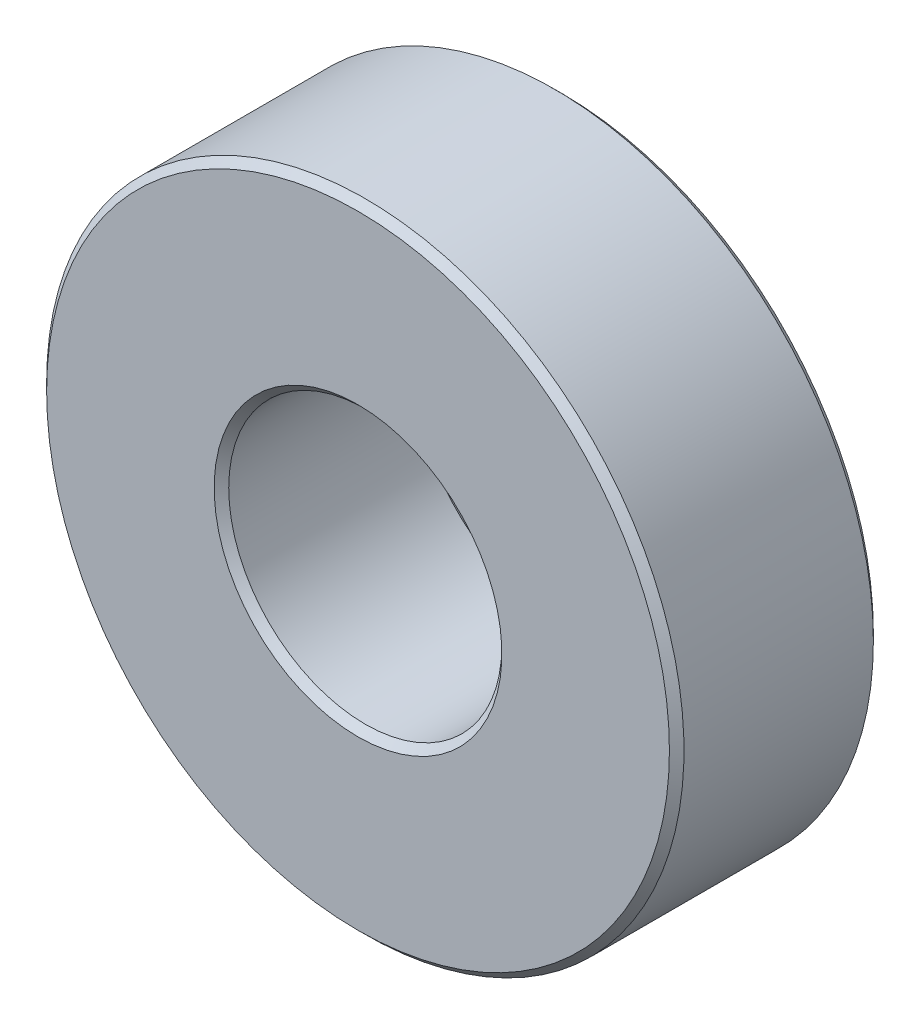
ISO-10303-21;
HEADER;
FILE_DESCRIPTION(('STEP AP214'),'2;1');
FILE_NAME('part.step','',(''),(''),'','','');
FILE_SCHEMA(('AUTOMOTIVE_DESIGN { 1 0 10303 214 1 1 1 1 }'));
ENDSEC;
DATA;
#1=APPLICATION_CONTEXT('core data for automotive mechanical design processes');
#2=APPLICATION_PROTOCOL_DEFINITION('international standard','automotive_design',2000,#1);
#3=PRODUCT_CONTEXT('',#1,'mechanical');
#4=PRODUCT('Part','Part','',(#3));
#5=PRODUCT_RELATED_PRODUCT_CATEGORY('part','',(#4));
#6=PRODUCT_DEFINITION_FORMATION('','',#4);
#7=PRODUCT_DEFINITION_CONTEXT('part definition',#1,'design');
#8=PRODUCT_DEFINITION('design','',#6,#7);
#9=PRODUCT_DEFINITION_SHAPE('','',#8);
#10=(LENGTH_UNIT() NAMED_UNIT(*) SI_UNIT(.MILLI.,.METRE.));
#11=(NAMED_UNIT(*) PLANE_ANGLE_UNIT() SI_UNIT($,.RADIAN.));
#12=(NAMED_UNIT(*) SI_UNIT($,.STERADIAN.) SOLID_ANGLE_UNIT());
#13=UNCERTAINTY_MEASURE_WITH_UNIT(LENGTH_MEASURE(1.E-05),#10,'distance_accuracy_value','');
#14=(GEOMETRIC_REPRESENTATION_CONTEXT(3) GLOBAL_UNCERTAINTY_ASSIGNED_CONTEXT((#13)) GLOBAL_UNIT_ASSIGNED_CONTEXT((#10,
#11,#12)) REPRESENTATION_CONTEXT('',''));
#15=CARTESIAN_POINT('',(0.,0.,0.));
#16=DIRECTION('',(0.,0.,1.));
#17=DIRECTION('',(1.,0.,0.));
#18=AXIS2_PLACEMENT_3D('',#15,#16,#17);
#19=CARTESIAN_POINT('',(0.,0.,0.));
#20=DIRECTION('',(0.,0.,-1.));
#21=DIRECTION('',(-1.,0.,0.));
#22=AXIS2_PLACEMENT_3D('',#19,#20,#21);
#23=PLANE('',#22);
#24=CARTESIAN_POINT('',(0.,0.,-5.6843418860808E-11));
#25=DIRECTION('',(0.,0.,-1.));
#26=DIRECTION('',(-1.,0.,0.));
#27=AXIS2_PLACEMENT_3D('',#24,#25,#26);
#28=CIRCLE('',#27,5.01650000001064);
#29=CARTESIAN_POINT('',(-5.01650000001064,0.,-5.6843418860808E-11));
#30=VERTEX_POINT('',#29);
#31=EDGE_CURVE('E32',#30,#30,#28,.F.);
#32=ORIENTED_EDGE('',*,*,#31,.T.);
#33=EDGE_LOOP('',(#32));
#34=FACE_BOUND('',#33,.T.);
#35=CARTESIAN_POINT('',(0.,0.,0.));
#36=DIRECTION('',(0.,0.,1.));
#37=DIRECTION('',(1.,0.,0.));
#38=AXIS2_PLACEMENT_3D('',#35,#36,#37);
#39=CIRCLE('',#38,10.8585);
#40=CARTESIAN_POINT('',(10.8585,0.,0.));
#41=VERTEX_POINT('',#40);
#42=EDGE_CURVE('E18',#41,#41,#39,.T.);
#43=ORIENTED_EDGE('',*,*,#42,.F.);
#44=EDGE_LOOP('',(#43));
#45=FACE_BOUND('',#44,.T.);
#46=ADVANCED_FACE('F15',(#34,#45),#23,.T.);
#47=CARTESIAN_POINT('',(0.,0.,0.254));
#48=DIRECTION('',(0.,0.,1.));
#49=DIRECTION('',(1.,0.,0.));
#50=AXIS2_PLACEMENT_3D('',#47,#48,#49);
#51=CONICAL_SURFACE('',#50,11.1125,0.785398163397451);
#52=ORIENTED_EDGE('',*,*,#42,.T.);
#53=EDGE_LOOP('',(#52));
#54=FACE_BOUND('',#53,.T.);
#55=CARTESIAN_POINT('',(0.,0.,0.254));
#56=DIRECTION('',(0.,0.,-1.));
#57=DIRECTION('',(-1.,0.,0.));
#58=AXIS2_PLACEMENT_3D('',#55,#56,#57);
#59=CIRCLE('',#58,11.1125);
#60=CARTESIAN_POINT('',(-11.1125,0.,0.254));
#61=VERTEX_POINT('',#60);
#62=EDGE_CURVE('E30',#61,#61,#59,.F.);
#63=ORIENTED_EDGE('',*,*,#62,.F.);
#64=EDGE_LOOP('',(#63));
#65=FACE_BOUND('',#64,.T.);
#66=ADVANCED_FACE('F41',(#54,#65),#51,.T.);
#67=CARTESIAN_POINT('',(0.,0.,-5.6843418860808E-11));
#68=DIRECTION('',(0.,0.,-1.));
#69=DIRECTION('',(-1.,0.,0.));
#70=AXIS2_PLACEMENT_3D('',#67,#68,#69);
#71=CONICAL_SURFACE('',#70,5.01650000001064,0.785398163285552);
#72=ORIENTED_EDGE('',*,*,#31,.F.);
#73=EDGE_LOOP('',(#72));
#74=FACE_BOUND('',#73,.T.);
#75=CARTESIAN_POINT('',(0.,0.,0.254));
#76=DIRECTION('',(0.,0.,-1.));
#77=DIRECTION('',(-1.,0.,0.));
#78=AXIS2_PLACEMENT_3D('',#75,#76,#77);
#79=CIRCLE('',#78,4.7625);
#80=CARTESIAN_POINT('',(-4.7625,0.,0.254));
#81=VERTEX_POINT('',#80);
#82=EDGE_CURVE('E37',#81,#81,#79,.F.);
#83=ORIENTED_EDGE('',*,*,#82,.T.);
#84=EDGE_LOOP('',(#83));
#85=FACE_BOUND('',#84,.T.);
#86=ADVANCED_FACE('F49',(#74,#85),#71,.F.);
#87=CARTESIAN_POINT('',(0.,0.,7.112));
#88=DIRECTION('',(0.,0.,-1.));
#89=DIRECTION('',(-1.,0.,0.));
#90=AXIS2_PLACEMENT_3D('',#87,#88,#89);
#91=CYLINDRICAL_SURFACE('',#90,11.1125);
#92=CARTESIAN_POINT('',(0.,0.,6.858));
#93=DIRECTION('',(0.,0.,-1.));
#94=DIRECTION('',(-1.,0.,0.));
#95=AXIS2_PLACEMENT_3D('',#92,#93,#94);
#96=CIRCLE('',#95,11.1125);
#97=CARTESIAN_POINT('',(-11.1125,0.,6.858));
#98=VERTEX_POINT('',#97);
#99=EDGE_CURVE('E80',#98,#98,#96,.F.);
#100=ORIENTED_EDGE('',*,*,#99,.F.);
#101=EDGE_LOOP('',(#100));
#102=FACE_BOUND('',#101,.T.);
#103=ORIENTED_EDGE('',*,*,#62,.T.);
#104=EDGE_LOOP('',(#103));
#105=FACE_BOUND('',#104,.T.);
#106=ADVANCED_FACE('F68',(#102,#105),#91,.T.);
#107=CARTESIAN_POINT('',(0.,0.,7.112));
#108=DIRECTION('',(0.,0.,-1.));
#109=DIRECTION('',(-1.,0.,0.));
#110=AXIS2_PLACEMENT_3D('',#107,#108,#109);
#111=CYLINDRICAL_SURFACE('',#110,4.7625);
#112=ORIENTED_EDGE('',*,*,#82,.F.);
#113=EDGE_LOOP('',(#112));
#114=FACE_BOUND('',#113,.T.);
#115=CARTESIAN_POINT('',(0.,0.,6.85800000002246));
#116=DIRECTION('',(0.,0.,1.));
#117=DIRECTION('',(1.,0.,0.));
#118=AXIS2_PLACEMENT_3D('',#115,#116,#117);
#119=CIRCLE('',#118,4.76250000002664);
#120=CARTESIAN_POINT('',(4.76250000002665,0.,6.85800000002246));
#121=VERTEX_POINT('',#120);
#122=EDGE_CURVE('E27',#121,#121,#119,.T.);
#123=ORIENTED_EDGE('',*,*,#122,.T.);
#124=EDGE_LOOP('',(#123));
#125=FACE_BOUND('',#124,.T.);
#126=ADVANCED_FACE('F64',(#114,#125),#111,.F.);
#127=CARTESIAN_POINT('',(0.,0.,6.858));
#128=DIRECTION('',(0.,0.,-1.));
#129=DIRECTION('',(-1.,0.,0.));
#130=AXIS2_PLACEMENT_3D('',#127,#128,#129);
#131=CONICAL_SURFACE('',#130,11.1125,0.785398163397452);
#132=CARTESIAN_POINT('',(0.,0.,7.112));
#133=DIRECTION('',(0.,0.,-1.));
#134=DIRECTION('',(-1.,0.,0.));
#135=AXIS2_PLACEMENT_3D('',#132,#133,#134);
#136=CIRCLE('',#135,10.8585);
#137=CARTESIAN_POINT('',(-10.8585,0.,7.112));
#138=VERTEX_POINT('',#137);
#139=EDGE_CURVE('E22',#138,#138,#136,.T.);
#140=ORIENTED_EDGE('',*,*,#139,.T.);
#141=EDGE_LOOP('',(#140));
#142=FACE_BOUND('',#141,.T.);
#143=ORIENTED_EDGE('',*,*,#99,.T.);
#144=EDGE_LOOP('',(#143));
#145=FACE_BOUND('',#144,.T.);
#146=ADVANCED_FACE('F58',(#142,#145),#131,.T.);
#147=CARTESIAN_POINT('',(0.,0.,7.11200000000645));
#148=DIRECTION('',(0.,0.,1.));
#149=DIRECTION('',(0.,-1.,0.));
#150=AXIS2_PLACEMENT_3D('',#147,#148,#149);
#151=CONICAL_SURFACE('',#150,5.01650000001063,0.785398163397448);
#152=CARTESIAN_POINT('',(0.,0.,7.11200000000645));
#153=DIRECTION('',(0.,0.,1.));
#154=DIRECTION('',(0.,-1.,0.));
#155=AXIS2_PLACEMENT_3D('',#152,#153,#154);
#156=CIRCLE('',#155,5.01650000001063);
#157=CARTESIAN_POINT('',(0.,-5.01650000001063,7.11200000000645));
#158=VERTEX_POINT('',#157);
#159=EDGE_CURVE('E10',#158,#158,#156,.T.);
#160=ORIENTED_EDGE('',*,*,#159,.T.);
#161=EDGE_LOOP('',(#160));
#162=FACE_BOUND('',#161,.T.);
#163=ORIENTED_EDGE('',*,*,#122,.F.);
#164=EDGE_LOOP('',(#163));
#165=FACE_BOUND('',#164,.T.);
#166=ADVANCED_FACE('F52',(#162,#165),#151,.F.);
#167=CARTESIAN_POINT('',(0.,0.,7.112));
#168=DIRECTION('',(0.,0.,-1.));
#169=DIRECTION('',(-1.,0.,0.));
#170=AXIS2_PLACEMENT_3D('',#167,#168,#169);
#171=PLANE('',#170);
#172=ORIENTED_EDGE('',*,*,#159,.F.);
#173=EDGE_LOOP('',(#172));
#174=FACE_BOUND('',#173,.T.);
#175=ORIENTED_EDGE('',*,*,#139,.F.);
#176=EDGE_LOOP('',(#175));
#177=FACE_BOUND('',#176,.T.);
#178=ADVANCED_FACE('F50',(#174,#177),#171,.F.);
#179=CLOSED_SHELL('',(#46,#66,#86,#106,#126,#146,#166,#178));
#180=MANIFOLD_SOLID_BREP('B1',#179);
#181=ADVANCED_BREP_SHAPE_REPRESENTATION('',(#18,#180),#14);
#182=SHAPE_DEFINITION_REPRESENTATION(#9,#181);
ENDSEC;
END-ISO-10303-21;
